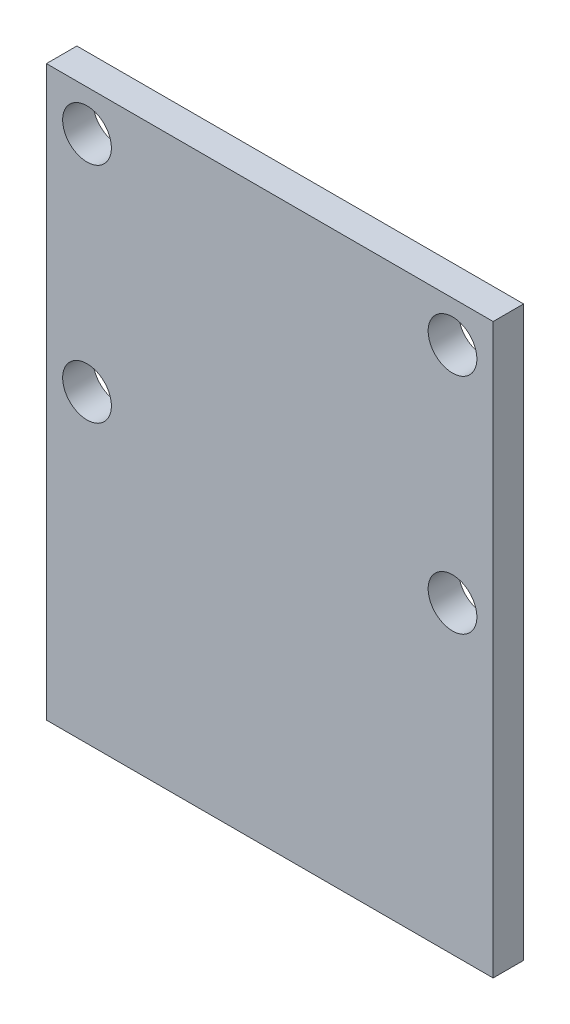
ISO-10303-21;
HEADER;
FILE_DESCRIPTION(('STEP AP214'),'2;1');
FILE_NAME('part.step','',(''),(''),'','','');
FILE_SCHEMA(('AUTOMOTIVE_DESIGN { 1 0 10303 214 1 1 1 1 }'));
ENDSEC;
DATA;
#1=APPLICATION_CONTEXT('core data for automotive mechanical design processes');
#2=APPLICATION_PROTOCOL_DEFINITION('international standard','automotive_design',2000,#1);
#3=PRODUCT_CONTEXT('',#1,'mechanical');
#4=PRODUCT('Part','Part','',(#3));
#5=PRODUCT_RELATED_PRODUCT_CATEGORY('part','',(#4));
#6=PRODUCT_DEFINITION_FORMATION('','',#4);
#7=PRODUCT_DEFINITION_CONTEXT('part definition',#1,'design');
#8=PRODUCT_DEFINITION('design','',#6,#7);
#9=PRODUCT_DEFINITION_SHAPE('','',#8);
#10=(LENGTH_UNIT() NAMED_UNIT(*) SI_UNIT(.MILLI.,.METRE.));
#11=(NAMED_UNIT(*) PLANE_ANGLE_UNIT() SI_UNIT($,.RADIAN.));
#12=(NAMED_UNIT(*) SI_UNIT($,.STERADIAN.) SOLID_ANGLE_UNIT());
#13=UNCERTAINTY_MEASURE_WITH_UNIT(LENGTH_MEASURE(1.E-05),#10,'distance_accuracy_value','');
#14=(GEOMETRIC_REPRESENTATION_CONTEXT(3) GLOBAL_UNCERTAINTY_ASSIGNED_CONTEXT((#13)) GLOBAL_UNIT_ASSIGNED_CONTEXT((#10,
#11,#12)) REPRESENTATION_CONTEXT('',''));
#15=CARTESIAN_POINT('',(0.,0.,0.));
#16=DIRECTION('',(0.,0.,1.));
#17=DIRECTION('',(1.,0.,0.));
#18=AXIS2_PLACEMENT_3D('',#15,#16,#17);
#19=CARTESIAN_POINT('',(11.,14.,1.5));
#20=DIRECTION('',(-1.,0.,0.));
#21=DIRECTION('',(0.,-1.,0.));
#22=AXIS2_PLACEMENT_3D('',#19,#20,#21);
#23=PLANE('',#22);
#24=DIRECTION('',(0.,1.,0.));
#25=VECTOR('',#24,1.);
#26=CARTESIAN_POINT('',(11.,14.,0.));
#27=LINE('',#26,#25);
#28=CARTESIAN_POINT('',(11.,-14.,0.));
#29=VERTEX_POINT('',#28);
#30=CARTESIAN_POINT('',(11.,14.,0.));
#31=VERTEX_POINT('',#30);
#32=EDGE_CURVE('E96',#29,#31,#27,.T.);
#33=ORIENTED_EDGE('',*,*,#32,.T.);
#34=DIRECTION('',(0.,0.,-1.));
#35=VECTOR('',#34,1.);
#36=CARTESIAN_POINT('',(11.,14.,1.5));
#37=LINE('',#36,#35);
#38=CARTESIAN_POINT('',(11.,14.,1.5));
#39=VERTEX_POINT('',#38);
#40=EDGE_CURVE('E11',#39,#31,#37,.T.);
#41=ORIENTED_EDGE('',*,*,#40,.F.);
#42=DIRECTION('',(0.,1.,0.));
#43=VECTOR('',#42,1.);
#44=CARTESIAN_POINT('',(11.,14.,1.5));
#45=LINE('',#44,#43);
#46=CARTESIAN_POINT('',(11.,-14.,1.5));
#47=VERTEX_POINT('',#46);
#48=EDGE_CURVE('E84',#47,#39,#45,.T.);
#49=ORIENTED_EDGE('',*,*,#48,.F.);
#50=DIRECTION('',(0.,0.,-1.));
#51=VECTOR('',#50,1.);
#52=CARTESIAN_POINT('',(11.,-14.,1.5));
#53=LINE('',#52,#51);
#54=EDGE_CURVE('E92',#47,#29,#53,.T.);
#55=ORIENTED_EDGE('',*,*,#54,.T.);
#56=EDGE_LOOP('',(#33,#41,#49,#55));
#57=FACE_BOUND('',#56,.T.);
#58=ADVANCED_FACE('F33',(#57),#23,.F.);
#59=CARTESIAN_POINT('',(-11.,14.,1.5));
#60=DIRECTION('',(0.,-1.,0.));
#61=DIRECTION('',(1.,0.,0.));
#62=AXIS2_PLACEMENT_3D('',#59,#60,#61);
#63=PLANE('',#62);
#64=DIRECTION('',(-1.,0.,0.));
#65=VECTOR('',#64,1.);
#66=CARTESIAN_POINT('',(-11.,14.,0.));
#67=LINE('',#66,#65);
#68=CARTESIAN_POINT('',(-11.,14.,0.));
#69=VERTEX_POINT('',#68);
#70=EDGE_CURVE('E88',#31,#69,#67,.T.);
#71=ORIENTED_EDGE('',*,*,#70,.T.);
#72=DIRECTION('',(0.,0.,-1.));
#73=VECTOR('',#72,1.);
#74=CARTESIAN_POINT('',(-11.,14.,1.5));
#75=LINE('',#74,#73);
#76=CARTESIAN_POINT('',(-11.,14.,1.5));
#77=VERTEX_POINT('',#76);
#78=EDGE_CURVE('E41',#77,#69,#75,.T.);
#79=ORIENTED_EDGE('',*,*,#78,.F.);
#80=DIRECTION('',(-1.,0.,0.));
#81=VECTOR('',#80,1.);
#82=CARTESIAN_POINT('',(-11.,14.,1.5));
#83=LINE('',#82,#81);
#84=EDGE_CURVE('E79',#39,#77,#83,.T.);
#85=ORIENTED_EDGE('',*,*,#84,.F.);
#86=ORIENTED_EDGE('',*,*,#40,.T.);
#87=EDGE_LOOP('',(#71,#79,#85,#86));
#88=FACE_BOUND('',#87,.T.);
#89=ADVANCED_FACE('F87',(#88),#63,.F.);
#90=CARTESIAN_POINT('',(-11.,14.,1.5));
#91=DIRECTION('',(1.,0.,0.));
#92=DIRECTION('',(0.,1.,0.));
#93=AXIS2_PLACEMENT_3D('',#90,#91,#92);
#94=PLANE('',#93);
#95=DIRECTION('',(0.,-1.,0.));
#96=VECTOR('',#95,1.);
#97=CARTESIAN_POINT('',(-11.,14.,0.));
#98=LINE('',#97,#96);
#99=CARTESIAN_POINT('',(-11.,-14.,0.));
#100=VERTEX_POINT('',#99);
#101=EDGE_CURVE('E66',#69,#100,#98,.T.);
#102=ORIENTED_EDGE('',*,*,#101,.T.);
#103=DIRECTION('',(0.,0.,-1.));
#104=VECTOR('',#103,1.);
#105=CARTESIAN_POINT('',(-11.,-14.,1.5));
#106=LINE('',#105,#104);
#107=CARTESIAN_POINT('',(-11.,-14.,1.5));
#108=VERTEX_POINT('',#107);
#109=EDGE_CURVE('E89',#108,#100,#106,.T.);
#110=ORIENTED_EDGE('',*,*,#109,.F.);
#111=DIRECTION('',(0.,-1.,0.));
#112=VECTOR('',#111,1.);
#113=CARTESIAN_POINT('',(-11.,14.,1.5));
#114=LINE('',#113,#112);
#115=EDGE_CURVE('E82',#77,#108,#114,.T.);
#116=ORIENTED_EDGE('',*,*,#115,.F.);
#117=ORIENTED_EDGE('',*,*,#78,.T.);
#118=EDGE_LOOP('',(#102,#110,#116,#117));
#119=FACE_BOUND('',#118,.T.);
#120=ADVANCED_FACE('F90',(#119),#94,.F.);
#121=CARTESIAN_POINT('',(-11.,-14.,1.5));
#122=DIRECTION('',(0.,1.,0.));
#123=DIRECTION('',(0.,0.,1.));
#124=AXIS2_PLACEMENT_3D('',#121,#122,#123);
#125=PLANE('',#124);
#126=DIRECTION('',(1.,0.,0.));
#127=VECTOR('',#126,1.);
#128=CARTESIAN_POINT('',(-11.,-14.,0.));
#129=LINE('',#128,#127);
#130=EDGE_CURVE('E72',#100,#29,#129,.T.);
#131=ORIENTED_EDGE('',*,*,#130,.T.);
#132=ORIENTED_EDGE('',*,*,#54,.F.);
#133=DIRECTION('',(1.,0.,0.));
#134=VECTOR('',#133,1.);
#135=CARTESIAN_POINT('',(-11.,-14.,1.5));
#136=LINE('',#135,#134);
#137=EDGE_CURVE('E49',#108,#47,#136,.T.);
#138=ORIENTED_EDGE('',*,*,#137,.F.);
#139=ORIENTED_EDGE('',*,*,#109,.T.);
#140=EDGE_LOOP('',(#131,#132,#138,#139));
#141=FACE_BOUND('',#140,.T.);
#142=ADVANCED_FACE('F104',(#141),#125,.F.);
#143=CARTESIAN_POINT('',(0.,0.,1.5));
#144=DIRECTION('',(0.,0.,1.));
#145=DIRECTION('',(1.,0.,0.));
#146=AXIS2_PLACEMENT_3D('',#143,#144,#145);
#147=PLANE('',#146);
#148=CARTESIAN_POINT('',(-9.,12.,1.5));
#149=DIRECTION('',(0.,0.,1.));
#150=DIRECTION('',(1.,0.,0.));
#151=AXIS2_PLACEMENT_3D('',#148,#149,#150);
#152=CIRCLE('',#151,1.19999999999999);
#153=CARTESIAN_POINT('',(-7.80000000000001,12.,1.5));
#154=VERTEX_POINT('',#153);
#155=EDGE_CURVE('E130',#154,#154,#152,.T.);
#156=ORIENTED_EDGE('',*,*,#155,.F.);
#157=EDGE_LOOP('',(#156));
#158=FACE_BOUND('',#157,.T.);
#159=CARTESIAN_POINT('',(9.,12.,1.5));
#160=DIRECTION('',(0.,0.,1.));
#161=DIRECTION('',(1.,0.,0.));
#162=AXIS2_PLACEMENT_3D('',#159,#160,#161);
#163=CIRCLE('',#162,1.19999999999999);
#164=CARTESIAN_POINT('',(10.2,12.,1.5));
#165=VERTEX_POINT('',#164);
#166=EDGE_CURVE('E124',#165,#165,#163,.T.);
#167=ORIENTED_EDGE('',*,*,#166,.F.);
#168=EDGE_LOOP('',(#167));
#169=FACE_BOUND('',#168,.T.);
#170=CARTESIAN_POINT('',(-9.,1.,1.5));
#171=DIRECTION('',(0.,0.,1.));
#172=DIRECTION('',(1.,0.,0.));
#173=AXIS2_PLACEMENT_3D('',#170,#171,#172);
#174=CIRCLE('',#173,1.19999999999999);
#175=CARTESIAN_POINT('',(-7.80000000000001,1.,1.5));
#176=VERTEX_POINT('',#175);
#177=EDGE_CURVE('E118',#176,#176,#174,.T.);
#178=ORIENTED_EDGE('',*,*,#177,.F.);
#179=EDGE_LOOP('',(#178));
#180=FACE_BOUND('',#179,.T.);
#181=CARTESIAN_POINT('',(9.,1.,1.5));
#182=DIRECTION('',(0.,0.,1.));
#183=DIRECTION('',(1.,0.,0.));
#184=AXIS2_PLACEMENT_3D('',#181,#182,#183);
#185=CIRCLE('',#184,1.19999999999999);
#186=CARTESIAN_POINT('',(10.2,1.,1.5));
#187=VERTEX_POINT('',#186);
#188=EDGE_CURVE('E112',#187,#187,#185,.T.);
#189=ORIENTED_EDGE('',*,*,#188,.F.);
#190=EDGE_LOOP('',(#189));
#191=FACE_BOUND('',#190,.T.);
#192=ORIENTED_EDGE('',*,*,#48,.T.);
#193=ORIENTED_EDGE('',*,*,#84,.T.);
#194=ORIENTED_EDGE('',*,*,#115,.T.);
#195=ORIENTED_EDGE('',*,*,#137,.T.);
#196=EDGE_LOOP('',(#192,#193,#194,#195));
#197=FACE_BOUND('',#196,.T.);
#198=ADVANCED_FACE('F80',(#158,#169,#180,#191,#197),#147,.T.);
#199=CARTESIAN_POINT('',(0.,0.,0.));
#200=DIRECTION('',(0.,0.,1.));
#201=DIRECTION('',(1.,0.,0.));
#202=AXIS2_PLACEMENT_3D('',#199,#200,#201);
#203=PLANE('',#202);
#204=CARTESIAN_POINT('',(-9.,12.,0.));
#205=DIRECTION('',(0.,0.,1.));
#206=DIRECTION('',(1.,0.,0.));
#207=AXIS2_PLACEMENT_3D('',#204,#205,#206);
#208=CIRCLE('',#207,1.2);
#209=CARTESIAN_POINT('',(-7.8,12.,0.));
#210=VERTEX_POINT('',#209);
#211=EDGE_CURVE('E127',#210,#210,#208,.T.);
#212=ORIENTED_EDGE('',*,*,#211,.T.);
#213=EDGE_LOOP('',(#212));
#214=FACE_BOUND('',#213,.T.);
#215=CARTESIAN_POINT('',(9.,12.,0.));
#216=DIRECTION('',(0.,0.,1.));
#217=DIRECTION('',(1.,0.,0.));
#218=AXIS2_PLACEMENT_3D('',#215,#216,#217);
#219=CIRCLE('',#218,1.2);
#220=CARTESIAN_POINT('',(10.2,12.,0.));
#221=VERTEX_POINT('',#220);
#222=EDGE_CURVE('E121',#221,#221,#219,.T.);
#223=ORIENTED_EDGE('',*,*,#222,.T.);
#224=EDGE_LOOP('',(#223));
#225=FACE_BOUND('',#224,.T.);
#226=CARTESIAN_POINT('',(-9.,1.,0.));
#227=DIRECTION('',(0.,0.,1.));
#228=DIRECTION('',(1.,0.,0.));
#229=AXIS2_PLACEMENT_3D('',#226,#227,#228);
#230=CIRCLE('',#229,1.2);
#231=CARTESIAN_POINT('',(-7.8,1.,0.));
#232=VERTEX_POINT('',#231);
#233=EDGE_CURVE('E115',#232,#232,#230,.T.);
#234=ORIENTED_EDGE('',*,*,#233,.T.);
#235=EDGE_LOOP('',(#234));
#236=FACE_BOUND('',#235,.T.);
#237=CARTESIAN_POINT('',(9.,1.,0.));
#238=DIRECTION('',(0.,0.,1.));
#239=DIRECTION('',(1.,0.,0.));
#240=AXIS2_PLACEMENT_3D('',#237,#238,#239);
#241=CIRCLE('',#240,1.2);
#242=CARTESIAN_POINT('',(10.2,1.,0.));
#243=VERTEX_POINT('',#242);
#244=EDGE_CURVE('E99',#243,#243,#241,.T.);
#245=ORIENTED_EDGE('',*,*,#244,.T.);
#246=EDGE_LOOP('',(#245));
#247=FACE_BOUND('',#246,.T.);
#248=ORIENTED_EDGE('',*,*,#32,.F.);
#249=ORIENTED_EDGE('',*,*,#130,.F.);
#250=ORIENTED_EDGE('',*,*,#101,.F.);
#251=ORIENTED_EDGE('',*,*,#70,.F.);
#252=EDGE_LOOP('',(#248,#249,#250,#251));
#253=FACE_BOUND('',#252,.T.);
#254=ADVANCED_FACE('F107',(#214,#225,#236,#247,#253),#203,.F.);
#255=CARTESIAN_POINT('',(9.,1.,1.5));
#256=DIRECTION('',(0.,0.,1.));
#257=DIRECTION('',(1.,0.,0.));
#258=AXIS2_PLACEMENT_3D('',#255,#256,#257);
#259=CYLINDRICAL_SURFACE('',#258,1.19999999999999);
#260=ORIENTED_EDGE('',*,*,#244,.F.);
#261=EDGE_LOOP('',(#260));
#262=FACE_BOUND('',#261,.T.);
#263=ORIENTED_EDGE('',*,*,#188,.T.);
#264=EDGE_LOOP('',(#263));
#265=FACE_BOUND('',#264,.T.);
#266=ADVANCED_FACE('F145',(#262,#265),#259,.F.);
#267=CARTESIAN_POINT('',(-9.,1.,1.5));
#268=DIRECTION('',(0.,0.,1.));
#269=DIRECTION('',(1.,0.,0.));
#270=AXIS2_PLACEMENT_3D('',#267,#268,#269);
#271=CYLINDRICAL_SURFACE('',#270,1.19999999999999);
#272=ORIENTED_EDGE('',*,*,#233,.F.);
#273=EDGE_LOOP('',(#272));
#274=FACE_BOUND('',#273,.T.);
#275=ORIENTED_EDGE('',*,*,#177,.T.);
#276=EDGE_LOOP('',(#275));
#277=FACE_BOUND('',#276,.T.);
#278=ADVANCED_FACE('F147',(#274,#277),#271,.F.);
#279=CARTESIAN_POINT('',(9.,12.,1.5));
#280=DIRECTION('',(0.,0.,1.));
#281=DIRECTION('',(1.,0.,0.));
#282=AXIS2_PLACEMENT_3D('',#279,#280,#281);
#283=CYLINDRICAL_SURFACE('',#282,1.19999999999999);
#284=ORIENTED_EDGE('',*,*,#222,.F.);
#285=EDGE_LOOP('',(#284));
#286=FACE_BOUND('',#285,.T.);
#287=ORIENTED_EDGE('',*,*,#166,.T.);
#288=EDGE_LOOP('',(#287));
#289=FACE_BOUND('',#288,.T.);
#290=ADVANCED_FACE('F154',(#286,#289),#283,.F.);
#291=CARTESIAN_POINT('',(-9.,12.,1.5));
#292=DIRECTION('',(0.,0.,1.));
#293=DIRECTION('',(1.,0.,0.));
#294=AXIS2_PLACEMENT_3D('',#291,#292,#293);
#295=CYLINDRICAL_SURFACE('',#294,1.19999999999999);
#296=ORIENTED_EDGE('',*,*,#211,.F.);
#297=EDGE_LOOP('',(#296));
#298=FACE_BOUND('',#297,.T.);
#299=ORIENTED_EDGE('',*,*,#155,.T.);
#300=EDGE_LOOP('',(#299));
#301=FACE_BOUND('',#300,.T.);
#302=ADVANCED_FACE('F134',(#298,#301),#295,.F.);
#303=CLOSED_SHELL('',(#58,#89,#120,#142,#198,#254,#266,#278,#290,#302));
#304=MANIFOLD_SOLID_BREP('B2',#303);
#305=ADVANCED_BREP_SHAPE_REPRESENTATION('',(#18,#304),#14);
#306=SHAPE_DEFINITION_REPRESENTATION(#9,#305);
ENDSEC;
END-ISO-10303-21;
